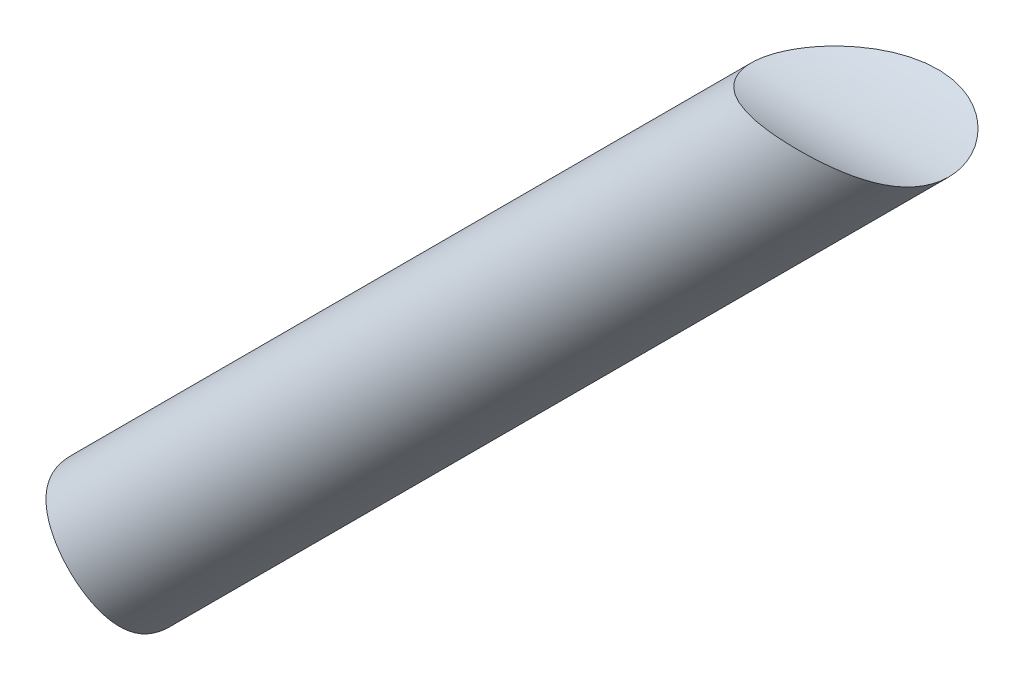
ISO-10303-21;
HEADER;
FILE_DESCRIPTION(('STEP AP214'),'2;1');
FILE_NAME('part.step','',(''),(''),'','','');
FILE_SCHEMA(('AUTOMOTIVE_DESIGN { 1 0 10303 214 1 1 1 1 }'));
ENDSEC;
DATA;
#1=APPLICATION_CONTEXT('core data for automotive mechanical design processes');
#2=APPLICATION_PROTOCOL_DEFINITION('international standard','automotive_design',2000,#1);
#3=PRODUCT_CONTEXT('',#1,'mechanical');
#4=PRODUCT('Part','Part','',(#3));
#5=PRODUCT_RELATED_PRODUCT_CATEGORY('part','',(#4));
#6=PRODUCT_DEFINITION_FORMATION('','',#4);
#7=PRODUCT_DEFINITION_CONTEXT('part definition',#1,'design');
#8=PRODUCT_DEFINITION('design','',#6,#7);
#9=PRODUCT_DEFINITION_SHAPE('','',#8);
#10=(LENGTH_UNIT() NAMED_UNIT(*) SI_UNIT(.MILLI.,.METRE.));
#11=(NAMED_UNIT(*) PLANE_ANGLE_UNIT() SI_UNIT($,.RADIAN.));
#12=(NAMED_UNIT(*) SI_UNIT($,.STERADIAN.) SOLID_ANGLE_UNIT());
#13=UNCERTAINTY_MEASURE_WITH_UNIT(LENGTH_MEASURE(1.E-05),#10,'distance_accuracy_value','');
#14=(GEOMETRIC_REPRESENTATION_CONTEXT(3) GLOBAL_UNCERTAINTY_ASSIGNED_CONTEXT((#13)) GLOBAL_UNIT_ASSIGNED_CONTEXT((#10,
#11,#12)) REPRESENTATION_CONTEXT('',''));
#15=CARTESIAN_POINT('',(0.,0.,0.));
#16=DIRECTION('',(0.,0.,1.));
#17=DIRECTION('',(1.,0.,0.));
#18=AXIS2_PLACEMENT_3D('',#15,#16,#17);
#19=CARTESIAN_POINT('',(77.0746391493327,77.0746391493346,10.));
#20=DIRECTION('',(-0.707106781186539,-0.707106781186556,0.));
#21=DIRECTION('',(0.707106781186556,-0.707106781186539,0.));
#22=AXIS2_PLACEMENT_3D('',#19,#20,#21);
#23=CYLINDRICAL_SURFACE('',#22,6.);
#24=CARTESIAN_POINT('',(75.8852813742368,67.4,10.));
#25=CARTESIAN_POINT('',(75.8852815124754,67.3999997379302,10.1598395629172));
#26=CARTESIAN_POINT('',(75.8793139100281,67.4030717450478,10.3196746745707));
#27=CARTESIAN_POINT('',(75.8554485569094,67.4152882815271,10.6382732568473));
#28=CARTESIAN_POINT('',(75.8375469340924,67.4244347818321,10.79703636275));
#29=CARTESIAN_POINT('',(75.7898455430541,67.4485801839576,11.1122611799213));
#30=CARTESIAN_POINT('',(75.7600496391315,67.4635771849897,11.2687236215449));
#31=CARTESIAN_POINT('',(75.6886151960445,67.4990611378244,11.5782861987423));
#32=CARTESIAN_POINT('',(75.6469767571852,67.5195480431279,11.7313863627822));
#33=CARTESIAN_POINT('',(75.551917569648,67.5655248889617,12.0332358016263));
#34=CARTESIAN_POINT('',(75.498488471756,67.5910183733407,12.1819819082648));
#35=CARTESIAN_POINT('',(75.3800368555393,67.6463493130862,12.4738846953391));
#36=CARTESIAN_POINT('',(75.3150185010834,67.6761852075772,12.6170433608255));
#37=CARTESIAN_POINT('',(75.1736009993334,67.7394446151721,12.8968020386602));
#38=CARTESIAN_POINT('',(75.097201578007,67.772868214655,13.0334018929812));
#39=CARTESIAN_POINT('',(74.9333504344412,67.8424308664143,13.2990732520277));
#40=CARTESIAN_POINT('',(74.8458988164286,67.8785698930818,13.4281448277313));
#41=CARTESIAN_POINT('',(74.6610648914562,67.9523416640405,13.6769800864918));
#42=CARTESIAN_POINT('',(74.5637592786814,67.9899616612996,13.796804533844));
#43=CARTESIAN_POINT('',(74.3592697772185,68.0659608607829,14.0274388624029));
#44=CARTESIAN_POINT('',(74.2520860232616,68.1043400526465,14.1382488665218));
#45=CARTESIAN_POINT('',(74.0285665029494,68.1808707478997,14.3502544705578));
#46=CARTESIAN_POINT('',(73.9122323449758,68.219022290041,14.451451753246));
#47=CARTESIAN_POINT('',(73.6712322231011,68.2941685681328,14.6438503304824));
#48=CARTESIAN_POINT('',(73.546566126058,68.3311632855837,14.7350514652337));
#49=CARTESIAN_POINT('',(73.2883181776644,68.4035701266641,14.9082611786457));
#50=CARTESIAN_POINT('',(73.1546487558198,68.438958538182,14.9901491114724));
#51=CARTESIAN_POINT('',(72.8807532491288,68.5069513884321,15.1434863123765));
#52=CARTESIAN_POINT('',(72.7405246171624,68.5395547315209,15.2149314800679));
#53=CARTESIAN_POINT('',(72.3115478223366,68.632241684167,15.4138029293905));
#54=CARTESIAN_POINT('',(72.0143869119642,68.687237065026,15.5258454385129));
#55=CARTESIAN_POINT('',(71.4931284475694,68.767430204055,15.6851803480726));
#56=CARTESIAN_POINT('',(71.2723494631297,68.796653208636,15.7418259199196));
#57=CARTESIAN_POINT('',(70.8259284561198,68.8465449488436,15.8372989235558));
#58=CARTESIAN_POINT('',(70.600284640212,68.867210471149,15.8761196627426));
#59=CARTESIAN_POINT('',(70.1458551623118,68.9001656181015,15.9375793161572));
#60=CARTESIAN_POINT('',(69.9170646643161,68.9124404180457,15.9601895932124));
#61=CARTESIAN_POINT('',(69.4582639582783,68.929045593545,15.9906958728094));
#62=CARTESIAN_POINT('',(69.2282537282401,68.93337582534,15.9985916090861));
#63=CARTESIAN_POINT('',(68.6538423448143,68.9350593480121,16.0016800248726));
#64=CARTESIAN_POINT('',(68.3093722611774,68.9278785791995,15.9886145894551));
#65=CARTESIAN_POINT('',(67.6229692400315,68.899511111573,15.9363338883472));
#66=CARTESIAN_POINT('',(67.2810378190434,68.8783166306561,15.897104092943));
#67=CARTESIAN_POINT('',(66.6004980883175,68.8241755290441,15.7947797275722));
#68=CARTESIAN_POINT('',(66.2619060033377,68.7911872165515,15.7316004465558));
#69=CARTESIAN_POINT('',(65.5908913248172,68.7156703682455,15.5828063567638));
#70=CARTESIAN_POINT('',(65.2584672525322,68.6731441519405,15.4971970018741));
#71=CARTESIAN_POINT('',(64.5853568561204,68.5783198236792,15.2992631259023));
#72=CARTESIAN_POINT('',(64.2450427121643,68.5256499541495,15.1858512865817));
#73=CARTESIAN_POINT('',(63.5745307864571,68.4141405315763,14.9339718895182));
#74=CARTESIAN_POINT('',(63.2443386933048,68.3552975885248,14.7954905339795));
#75=CARTESIAN_POINT('',(62.7600688148906,68.2642598676447,14.5679461220187));
#76=CARTESIAN_POINT('',(62.6008957522202,68.2335381458015,14.4890331048443));
#77=CARTESIAN_POINT('',(62.2864055248103,68.1714161151899,14.3241294868241));
#78=CARTESIAN_POINT('',(62.1310877518616,68.1400159149389,14.2381400117143));
#79=CARTESIAN_POINT('',(61.8251114334625,68.0768876757817,14.0587005774971));
#80=CARTESIAN_POINT('',(61.6744480740916,68.0451600241946,13.9652587108124));
#81=CARTESIAN_POINT('',(61.3784891672176,67.9817140138422,13.7702750133171));
#82=CARTESIAN_POINT('',(61.2331920832487,67.9499956550373,13.668735527729));
#83=CARTESIAN_POINT('',(60.987678935671,67.8955562170633,13.4856562966612));
#84=CARTESIAN_POINT('',(60.8859462583414,67.8727334989394,13.4061845234753));
#85=CARTESIAN_POINT('',(60.6864872119403,67.827522118368,13.2422980622385));
#86=CARTESIAN_POINT('',(60.5887604835964,67.805133417091,13.157883819108));
#87=CARTESIAN_POINT('',(60.3022483021664,67.7388767037206,12.8964652461113));
#88=CARTESIAN_POINT('',(60.1202993823323,67.6959556948688,12.7114081820063));
#89=CARTESIAN_POINT('',(59.8660324980736,67.6351085156795,12.415102731241));
#90=CARTESIAN_POINT('',(59.7839498347091,67.6153069088888,12.3125393055681));
#91=CARTESIAN_POINT('',(59.6277712538589,67.5773864073786,12.1011278518762));
#92=CARTESIAN_POINT('',(59.553676330093,67.5592677220627,11.992279044501));
#93=CARTESIAN_POINT('',(59.4152242581805,67.5252272133797,11.7685466071954));
#94=CARTESIAN_POINT('',(59.3508441893598,67.5093002271249,11.6536780715942));
#95=CARTESIAN_POINT('',(59.2334189174398,67.4801242194581,11.4180218974718));
#96=CARTESIAN_POINT('',(59.1803672721936,67.4668736762634,11.2972376713369));
#97=CARTESIAN_POINT('',(59.0705652167238,67.4393621061804,11.0054728110215));
#98=CARTESIAN_POINT('',(59.0194454845528,67.4264760233515,10.8321679559407));
#99=CARTESIAN_POINT('',(58.9460570273946,67.4079439181919,10.4792482671981));
#100=CARTESIAN_POINT('',(58.923758805838,67.4022904938599,10.2996400782405));
#101=CARTESIAN_POINT('',(58.910161080693,67.3988453565914,9.93866913021494));
#102=CARTESIAN_POINT('',(58.9189415258144,67.4010739197622,9.75730304459917));
#103=CARTESIAN_POINT('',(58.9667520148335,67.4131714635371,9.39885669047514));
#104=CARTESIAN_POINT('',(59.005805028596,67.4230462458435,9.22177978171849));
#105=CARTESIAN_POINT('',(59.1218840762085,67.4522456510986,8.83906439317466));
#106=CARTESIAN_POINT('',(59.2052839304874,67.4731491754544,8.63550403931217));
#107=CARTESIAN_POINT('',(59.4030072662934,67.5222434546702,8.24496809809244));
#108=CARTESIAN_POINT('',(59.517388294476,67.5504477661711,8.0580242423762));
#109=CARTESIAN_POINT('',(59.7401382297937,67.6047268071969,7.74265207051718));
#110=CARTESIAN_POINT('',(59.8438286343237,67.6297968811766,7.6106607275377));
#111=CARTESIAN_POINT('',(60.0621688151239,67.6820429299041,7.35644640916479));
#112=CARTESIAN_POINT('',(60.1768247830611,67.709220092753,7.23422902496779));
#113=CARTESIAN_POINT('',(60.4150689129569,67.7650275226496,6.99881588743163));
#114=CARTESIAN_POINT('',(60.5386726351652,67.7936602939685,6.88563660670132));
#115=CARTESIAN_POINT('',(60.7930177703062,67.8517965539926,6.66781042996424));
#116=CARTESIAN_POINT('',(60.9237618105869,67.8813003613441,6.56316671049848));
#117=CARTESIAN_POINT('',(61.295952643645,67.9640342134289,6.2827516566759));
#118=CARTESIAN_POINT('',(61.5437916030401,68.0177222898052,6.11557182319901));
#119=CARTESIAN_POINT('',(62.0530897590377,68.1244608550145,5.80311011898068));
#120=CARTESIAN_POINT('',(62.3145595524975,68.1775108071082,5.65784563780407));
#121=CARTESIAN_POINT('',(62.8483651496075,68.2815171778423,5.3867635058964));
#122=CARTESIAN_POINT('',(63.120720000812,68.3324695787923,5.26098200675687));
#123=CARTESIAN_POINT('',(63.6736282237214,68.4308223401642,5.0276802470737));
#124=CARTESIAN_POINT('',(63.9541793629931,68.478223655491,4.92015506739312));
#125=CARTESIAN_POINT('',(64.5466907982359,68.5721258507796,4.713867368748));
#126=CARTESIAN_POINT('',(64.8592657887626,68.618192560341,4.61667220284539));
#127=CARTESIAN_POINT('',(65.4910307994879,68.70300170511,4.44242779824431));
#128=CARTESIAN_POINT('',(65.8102221967229,68.7417425983029,4.36538279966019));
#129=CARTESIAN_POINT('',(66.453401363601,68.810057367316,4.23209137269348));
#130=CARTESIAN_POINT('',(66.7773811882099,68.8396449572769,4.17581380440784));
#131=CARTESIAN_POINT('',(67.4291870734347,68.8877874067195,4.08528684393991));
#132=CARTESIAN_POINT('',(67.7570117360719,68.9063461567617,4.05102968343622));
#133=CARTESIAN_POINT('',(68.3213579603817,68.9269551091747,4.01313264977109));
#134=CARTESIAN_POINT('',(68.5573708929337,68.9321967188805,4.00356078494131));
#135=CARTESIAN_POINT('',(69.0296423402265,68.9351949991782,3.99807707881385));
#136=CARTESIAN_POINT('',(69.2659008500615,68.9329518165251,4.002164969688));
#137=CARTESIAN_POINT('',(69.737221855235,68.9202685181246,4.02541412598633));
#138=CARTESIAN_POINT('',(69.9722853990614,68.9098376513099,4.04455838355646));
#139=CARTESIAN_POINT('',(70.4399111998853,68.8802141031314,4.09954948561711));
#140=CARTESIAN_POINT('',(70.6724740101207,68.8610234022988,4.13539255467224));
#141=CARTESIAN_POINT('',(71.0860384413827,68.8184432435308,4.21634041354156));
#142=CARTESIAN_POINT('',(71.2678738334506,68.7967107419533,4.2580606530241));
#143=CARTESIAN_POINT('',(71.627399977225,68.7475821624634,4.35407292349448));
#144=CARTESIAN_POINT('',(71.8050917612385,68.7201875123192,4.40836178559063));
#145=CARTESIAN_POINT('',(72.1548517607636,68.6600365243145,4.53027999060202));
#146=CARTESIAN_POINT('',(72.3269221608237,68.6272822997234,4.5979040776121));
#147=CARTESIAN_POINT('',(72.6639151881279,68.556987607884,4.74710871478473));
#148=CARTESIAN_POINT('',(72.8288378040491,68.5194471330541,4.82868928705489));
#149=CARTESIAN_POINT('',(73.1512437663602,68.4401345814324,5.00689764002309));
#150=CARTESIAN_POINT('',(73.3086507429652,68.3983288215565,5.10364905101125));
#151=CARTESIAN_POINT('',(73.6127976010068,68.3119842686393,5.311656983295));
#152=CARTESIAN_POINT('',(73.7595372330361,68.2674454117418,5.42291384356491));
#153=CARTESIAN_POINT('',(74.0407497600931,68.1771233512998,5.65947258877787));
#154=CARTESIAN_POINT('',(74.175225804724,68.1313404711951,5.78477084900038));
#155=CARTESIAN_POINT('',(74.4306102140519,68.04014965377,6.04861901582392));
#156=CARTESIAN_POINT('',(74.5515202824194,67.9947416700336,6.18716725438153));
#157=CARTESIAN_POINT('',(74.7633491186308,67.9119720158973,6.45679539239527));
#158=CARTESIAN_POINT('',(74.8561126082869,67.8743524701612,6.58635268184652));
#159=CARTESIAN_POINT('',(75.0301932952715,67.8016762938402,6.85361593032828));
#160=CARTESIAN_POINT('',(75.1115111945609,67.7666195061442,6.99132138889319));
#161=CARTESIAN_POINT('',(75.2623211302989,67.7000269331917,7.27388092529851));
#162=CARTESIAN_POINT('',(75.331812543797,67.668491333441,7.41873537918834));
#163=CARTESIAN_POINT('',(75.4587011340757,67.6097903044356,7.7145071202974));
#164=CARTESIAN_POINT('',(75.5160976750283,67.5826251049509,7.86542472576048));
#165=CARTESIAN_POINT('',(75.6201915512146,67.532625973984,8.1769000415228));
#166=CARTESIAN_POINT('',(75.6665055833312,67.5099509282622,8.33761148378618));
#167=CARTESIAN_POINT('',(75.7459685443341,67.4706301806932,8.66298092288616));
#168=CARTESIAN_POINT('',(75.7791170669798,67.4539846648971,8.8276390413369));
#169=CARTESIAN_POINT('',(75.8321773154528,67.4271719738417,9.15959034606917));
#170=CARTESIAN_POINT('',(75.8520892572382,67.4170046928885,9.32688348931401));
#171=CARTESIAN_POINT('',(75.8786409075299,67.4034189998845,9.66278611337812));
#172=CARTESIAN_POINT('',(75.8852812284179,67.4000002764406,9.83139553310109));
#173=CARTESIAN_POINT('',(75.8852813742368,67.4,10.));
#174=B_SPLINE_CURVE_WITH_KNOTS('',3,(#24,#25,#26,#27,#28,#29,#30,#31,#32,#33,#34,#35,#36,#37,
#38,#39,#40,#41,#42,#43,#44,#45,#46,#47,#48,#49,#50,#51,#52,#53,#54,#55,#56,#57,#58,#59,#60,#61,
#62,#63,#64,#65,#66,#67,#68,#69,#70,#71,#72,#73,#74,#75,#76,#77,#78,#79,#80,#81,#82,#83,#84,#85,
#86,#87,#88,#89,#90,#91,#92,#93,#94,#95,#96,#97,#98,#99,#100,#101,#102,#103,#104,#105,#106,#107,
#108,#109,#110,#111,#112,#113,#114,#115,#116,#117,#118,#119,#120,#121,#122,#123,#124,#125,#126,
#127,#128,#129,#130,#131,#132,#133,#134,#135,#136,#137,#138,#139,#140,#141,#142,#143,#144,#145,
#146,#147,#148,#149,#150,#151,#152,#153,#154,#155,#156,#157,#158,#159,#160,#161,#162,#163,#164,
#165,#166,#167,#168,#169,#170,#171,#172,#173),.UNSPECIFIED.,.T.,.F.,(4,2,2,2,2,2,2,2,2,2,2,2,2,
2,2,2,2,2,2,2,2,2,2,2,2,2,2,2,2,2,2,2,2,2,2,2,2,2,2,2,2,2,2,2,2,2,2,2,2,2,2,2,2,2,2,2,2,2,2,2,2,
2,2,2,2,2,2,2,2,2,2,2,2,2,4),(0.,0.479370312012818,0.958896237606557,1.43826649803438,
1.91763269836793,2.39733944350974,2.87687418241217,3.35642046937655,3.83596223436,
4.31202303912531,4.78807735170664,5.2640481736251,5.74002660322964,6.22159953628903,
6.70336105547851,7.66643873458003,8.3549919755339,9.04380353321576,9.73382895720589,
10.4238668673464,11.4566648267743,12.4900368024333,13.5270985200153,14.563908309061,
15.6506102744644,16.7379121689329,17.2786592410904,17.8193204558792,18.3594023671161,
18.8993284246132,19.292461971262,19.685560182338,20.4723902465014,20.8706283127834,
21.2689158650939,21.6662485121655,22.0633546023439,22.6044135075683,23.1449182415946,
23.6868144132784,24.2291221615495,24.8884067089782,25.5489243578605,26.0573737285476,
26.5661119077081,27.0757570864119,27.5855910742407,28.495330417664,29.4057878737984,
30.3179149949504,31.2297959534806,32.2207162090707,33.211844812352,34.2014811616237,
35.1907681968115,35.8991218609331,36.6074616363763,37.315002409898,38.022383293053,
38.5853544270075,39.1481837749054,39.7107917327347,40.273400581765,40.8408585065509,
41.4083296945008,41.9756547284537,42.5429084354824,43.0334732113224,43.5240078875823,
44.0145683943662,44.5051546835081,45.0108275534495,45.5165160254394,46.0221962467934,
46.5278531344187),.UNSPECIFIED.);
#175=CARTESIAN_POINT('',(75.8852813742368,67.4,10.));
#176=VERTEX_POINT('',#175);
#177=EDGE_CURVE('E10',#176,#176,#174,.T.);
#178=ORIENTED_EDGE('',*,*,#177,.T.);
#179=EDGE_LOOP('',(#178));
#180=FACE_BOUND('',#179,.T.);
#181=CARTESIAN_POINT('',(8.98605717737184,0.500775803133386,10.));
#182=CARTESIAN_POINT('',(8.98605748508666,0.500776715105243,9.85353533955458));
#183=CARTESIAN_POINT('',(8.98566431542602,0.507983001174149,9.70705852058332));
#184=CARTESIAN_POINT('',(8.98400319168465,0.536550250595204,9.41549334836636));
#185=CARTESIAN_POINT('',(8.98273509810425,0.557913471136532,9.27040522027707));
#186=CARTESIAN_POINT('',(8.97906773699204,0.614109950410626,8.9826964860356));
#187=CARTESIAN_POINT('',(8.97666703582628,0.648960270791826,8.84007924535678));
#188=CARTESIAN_POINT('',(8.9703522750901,0.731075186532771,8.55847442040169));
#189=CARTESIAN_POINT('',(8.96643744082747,0.778346132814749,8.41948873310037));
#190=CARTESIAN_POINT('',(8.95182310530101,0.935899861828673,8.0119839541291));
#191=CARTESIAN_POINT('',(8.9382330667686,1.0625811491345,7.74978239628315));
#192=CARTESIAN_POINT('',(8.89932142802268,1.35022834063619,7.2463570070115));
#193=CARTESIAN_POINT('',(8.87399739049877,1.51120136393503,7.005137546221));
#194=CARTESIAN_POINT('',(8.80237997053112,1.88680036029616,6.50904968030411));
#195=CARTESIAN_POINT('',(8.75343614164094,2.10587755876238,6.25790125136211));
#196=CARTESIAN_POINT('',(8.65995526376616,2.45350508863379,5.90553487710377));
#197=CARTESIAN_POINT('',(8.625416005795,2.57264988351927,5.79205984776456));
#198=CARTESIAN_POINT('',(8.54895390301103,2.81632202456468,5.57357874104262));
#199=CARTESIAN_POINT('',(8.50702950204676,2.94085050095928,5.46857445537456));
#200=CARTESIAN_POINT('',(8.40852143722022,3.21256471971153,5.25302356570355));
#201=CARTESIAN_POINT('',(8.3506936683514,3.36041770276928,5.14388076601325));
#202=CARTESIAN_POINT('',(8.2237705104555,3.66006213814201,4.93842334985244));
#203=CARTESIAN_POINT('',(8.15468034039802,3.81185173897092,4.84210282894858));
#204=CARTESIAN_POINT('',(8.00462614788177,4.11763839804422,4.66337186290874));
#205=CARTESIAN_POINT('',(7.9236686741983,4.27163419681577,4.58095379953703));
#206=CARTESIAN_POINT('',(7.7495004367911,4.58001932261517,4.43116821944084));
#207=CARTESIAN_POINT('',(7.65629230455013,4.73440855816723,4.36379747886613));
#208=CARTESIAN_POINT('',(7.46877824194229,5.02431364866204,4.25193277800074));
#209=CARTESIAN_POINT('',(7.37576719693979,5.16000471137216,4.20572075155552));
#210=CARTESIAN_POINT('',(7.18039517201674,5.42858051473185,4.12683883465592));
#211=CARTESIAN_POINT('',(7.07803482338081,5.56146544411257,4.09416803069345));
#212=CARTESIAN_POINT('',(6.86469359412446,5.82274837614251,4.04299075998501));
#213=CARTESIAN_POINT('',(6.753721871875,5.9511509406826,4.02446946634038));
#214=CARTESIAN_POINT('',(6.52399818559896,6.20212639834889,4.00190057905336));
#215=CARTESIAN_POINT('',(6.40524732173902,6.32470011160782,3.99785094323472));
#216=CARTESIAN_POINT('',(6.17979847442522,6.54453802199324,4.00380386394787));
#217=CARTESIAN_POINT('',(6.07402295848694,6.64281189889591,4.0117582601211));
#218=CARTESIAN_POINT('',(5.85855891564711,6.83359303029516,4.03799884751359));
#219=CARTESIAN_POINT('',(5.74886916484896,6.92609845583632,4.05628829727489));
#220=CARTESIAN_POINT('',(5.52656630989229,7.10474452877348,4.10294041323731));
#221=CARTESIAN_POINT('',(5.41395424614452,7.19088740048921,4.1312995387975));
#222=CARTESIAN_POINT('',(5.18666118239224,7.35651623529629,4.19773514426556));
#223=CARTESIAN_POINT('',(5.07197939614468,7.43599960101577,4.23581539243375));
#224=CARTESIAN_POINT('',(4.84201837347689,7.5877365732828,4.32105185736134));
#225=CARTESIAN_POINT('',(4.72674402982839,7.66002062940021,4.36816714681505));
#226=CARTESIAN_POINT('',(4.49595510550711,7.79772243609836,4.47109302065698));
#227=CARTESIAN_POINT('',(4.38044045458605,7.86313776218351,4.52690665819778));
#228=CARTESIAN_POINT('',(4.03486538226507,8.04910832500886,4.70661218914095));
#229=CARTESIAN_POINT('',(3.80560295549912,8.15949920836031,4.84283256169071));
#230=CARTESIAN_POINT('',(3.32598206487999,8.36749583132788,5.16394640953883));
#231=CARTESIAN_POINT('',(3.07681029984164,8.46151529724982,5.35288364781414));
#232=CARTESIAN_POINT('',(2.59651360058346,8.62103123008849,5.76371498955021));
#233=CARTESIAN_POINT('',(2.36541735916533,8.68648307433593,5.98565993133308));
#234=CARTESIAN_POINT('',(2.02179684657401,8.77092871123242,6.35917635569087));
#235=CARTESIAN_POINT('',(1.90038363104708,8.79787257762297,6.50092994883038));
#236=CARTESIAN_POINT('',(1.66815279163798,8.8448468219153,6.79394613102645));
#237=CARTESIAN_POINT('',(1.55733755331987,8.86487564590332,6.94521084835957));
#238=CARTESIAN_POINT('',(1.24408085642263,8.91609731835174,7.41229409891757));
#239=CARTESIAN_POINT('',(1.06013337626928,8.93857997349688,7.74213841668404));
#240=CARTESIAN_POINT('',(0.80459997577114,8.96461526136673,8.33424408902749));
#241=CARTESIAN_POINT('',(0.715931080922988,8.97173766558987,8.58895785799819));
#242=CARTESIAN_POINT('',(0.6153267107385,8.97900035560513,8.97918020995198));
#243=CARTESIAN_POINT('',(0.587196561503596,8.98085104201405,9.11055843084267));
#244=CARTESIAN_POINT('',(0.542398883299607,8.98366994067957,9.37529459255317));
#245=CARTESIAN_POINT('',(0.525731400655785,8.98463814936972,9.50865254137163));
#246=CARTESIAN_POINT('',(0.504312347600356,8.98586573518108,9.77692072440333));
#247=CARTESIAN_POINT('',(0.49961364911089,8.98612196760859,9.91183521059274));
#248=CARTESIAN_POINT('',(0.502424557579199,8.98596526355377,10.1815353067702));
#249=CARTESIAN_POINT('',(0.509934193809178,8.98555232546695,10.3163209164485));
#250=CARTESIAN_POINT('',(0.536944789347177,8.98397867548309,10.5847475286685));
#251=CARTESIAN_POINT('',(0.556451870985778,8.98281758178568,10.718387911471));
#252=CARTESIAN_POINT('',(0.606893173679524,8.9795494202355,10.9835024085941));
#253=CARTESIAN_POINT('',(0.637832202063527,8.97744195433666,11.114975587237));
#254=CARTESIAN_POINT('',(0.743052033240096,8.96954344316902,11.492007216002));
#255=CARTESIAN_POINT('',(0.831278729539247,8.96214423356105,11.7337383135175));
#256=CARTESIAN_POINT('',(1.03959703488613,8.94036463573213,12.2024235381302));
#257=CARTESIAN_POINT('',(1.159699344214,8.92598190187434,12.4293726711699));
#258=CARTESIAN_POINT('',(1.45199733482331,8.88355905183044,12.9105841709742));
#259=CARTESIAN_POINT('',(1.62980710676585,8.85336372371296,13.1612388836525));
#260=CARTESIAN_POINT('',(2.01336621522275,8.77409463424757,13.6372819974521));
#261=CARTESIAN_POINT('',(2.21914948888563,8.72499780716688,13.8626390918968));
#262=CARTESIAN_POINT('',(2.56676624018393,8.62731018148383,14.2030631410588));
#263=CARTESIAN_POINT('',(2.70222566369532,8.58599546558213,14.3268563705124));
#264=CARTESIAN_POINT('',(2.97927512209322,8.4938332465648,14.5635350859104));
#265=CARTESIAN_POINT('',(3.12086335910756,8.44298852467249,14.6764237397019));
#266=CARTESIAN_POINT('',(3.40863813546259,8.33096778423523,14.8904761144477));
#267=CARTESIAN_POINT('',(3.55482254815174,8.26979648817781,14.9916451594427));
#268=CARTESIAN_POINT('',(3.85030353985587,8.1364251253218,15.1813651954553));
#269=CARTESIAN_POINT('',(3.99959927201532,8.06422802658531,15.2699195698837));
#270=CARTESIAN_POINT('',(4.27082620353105,7.92330184538411,15.4176597669847));
#271=CARTESIAN_POINT('',(4.39250659412256,7.8565693175159,15.4792197033721));
#272=CARTESIAN_POINT('',(4.63586949460448,7.71547053617401,15.5928276352721));
#273=CARTESIAN_POINT('',(4.75755199912423,7.64110582407131,15.6448775455181));
#274=CARTESIAN_POINT('',(4.99984918890377,7.48480314273828,15.7388635850186));
#275=CARTESIAN_POINT('',(5.12046449755448,7.40286996546244,15.7808060538774));
#276=CARTESIAN_POINT('',(5.35964844664254,7.23158365183555,15.8540865879077));
#277=CARTESIAN_POINT('',(5.47821705736491,7.14223040786553,15.8854244992397));
#278=CARTESIAN_POINT('',(5.71275174564379,6.95607508169427,15.9371681578718));
#279=CARTESIAN_POINT('',(5.82870368490285,6.85924124227127,15.9575239967584));
#280=CARTESIAN_POINT('',(6.05637530908576,6.65907586107646,15.986774502487));
#281=CARTESIAN_POINT('',(6.16809498730894,6.55574430901791,15.995669151184));
#282=CARTESIAN_POINT('',(6.38629654944063,6.34337399971892,16.001854831984));
#283=CARTESIAN_POINT('',(6.49277874499912,6.23433558285733,15.9991465553517));
#284=CARTESIAN_POINT('',(6.69963992086908,6.01148369331323,15.9821711851083));
#285=CARTESIAN_POINT('',(6.80001917871507,5.89767043816757,15.9679046175401));
#286=CARTESIAN_POINT('',(6.98688977241233,5.67476499767939,15.9294974262782));
#287=CARTESIAN_POINT('',(7.07385997828289,5.56593510521711,15.9061540573999));
#288=CARTESIAN_POINT('',(7.24158560978146,5.34589414652316,15.8500229539068));
#289=CARTESIAN_POINT('',(7.32233891603668,5.23468228463611,15.817232016476));
#290=CARTESIAN_POINT('',(7.4773176587121,5.01081259249963,15.7426038656972));
#291=CARTESIAN_POINT('',(7.55154505928831,4.89815520909998,15.7007693874612));
#292=CARTESIAN_POINT('',(7.69340351486184,4.67219185873221,15.6084944653482));
#293=CARTESIAN_POINT('',(7.76103201694917,4.55888565856263,15.5580507113929));
#294=CARTESIAN_POINT('',(7.96136729200874,4.20621616628193,15.3882336102895));
#295=CARTESIAN_POINT('',(8.08266579292347,3.96700646174869,15.2546624130753));
#296=CARTESIAN_POINT('',(8.29715767010434,3.496329495457,14.955534722562));
#297=CARTESIAN_POINT('',(8.39033414348089,3.26486696418471,14.7899590905111));
#298=CARTESIAN_POINT('',(8.56423679074711,2.7802880495803,14.4021174657146));
#299=CARTESIAN_POINT('',(8.64069991415427,2.52949158901817,14.1750310614749));
#300=CARTESIAN_POINT('',(8.76558146870231,2.05541500564543,13.6866592427667));
#301=CARTESIAN_POINT('',(8.81397896891916,1.83215551693998,13.425348481859));
#302=CARTESIAN_POINT('',(8.88615693534993,1.43976135134894,12.8923938578693));
#303=CARTESIAN_POINT('',(8.91153454747748,1.2677959757666,12.6230614920584));
#304=CARTESIAN_POINT('',(8.94907137403238,0.967993764628033,12.060159705955));
#305=CARTESIAN_POINT('',(8.96125634539022,0.840071275426004,11.766638721549));
#306=CARTESIAN_POINT('',(8.97588821441748,0.663015879892927,11.2276476092741));
#307=CARTESIAN_POINT('',(8.97989496499691,0.602703722460836,10.9859480951284));
#308=CARTESIAN_POINT('',(8.98369509124213,0.54183007808923,10.6186608270821));
#309=CARTESIAN_POINT('',(8.98459345159414,0.526471254538798,10.4954328923675));
#310=CARTESIAN_POINT('',(8.985774287632,0.505944999806338,10.2481394026301));
#311=CARTESIAN_POINT('',(8.98605691669852,0.500775030578054,10.1240740639336));
#312=CARTESIAN_POINT('',(8.98605717737184,0.500775803133386,10.));
#313=B_SPLINE_CURVE_WITH_KNOTS('',3,(#181,#182,#183,#184,#185,#186,#187,#188,#189,#190,#191,
#192,#193,#194,#195,#196,#197,#198,#199,#200,#201,#202,#203,#204,#205,#206,#207,#208,#209,#210,
#211,#212,#213,#214,#215,#216,#217,#218,#219,#220,#221,#222,#223,#224,#225,#226,#227,#228,#229,
#230,#231,#232,#233,#234,#235,#236,#237,#238,#239,#240,#241,#242,#243,#244,#245,#246,#247,#248,
#249,#250,#251,#252,#253,#254,#255,#256,#257,#258,#259,#260,#261,#262,#263,#264,#265,#266,#267,
#268,#269,#270,#271,#272,#273,#274,#275,#276,#277,#278,#279,#280,#281,#282,#283,#284,#285,#286,
#287,#288,#289,#290,#291,#292,#293,#294,#295,#296,#297,#298,#299,#300,#301,#302,#303,#304,#305,
#306,#307,#308,#309,#310,#311,#312),.UNSPECIFIED.,.T.,.F.,(4,2,2,2,2,2,2,2,2,2,2,2,2,2,2,2,2,2,
2,2,2,2,2,2,2,2,2,2,2,2,2,2,2,2,2,2,2,2,2,2,2,2,2,2,2,2,2,2,2,2,2,2,2,2,2,2,2,2,2,2,2,2,2,2,2,
4),(0.,0.439240150409468,0.878550350357974,1.31841811918743,1.75851124064944,2.6292120675204,
3.50009383186805,4.50653442593667,5.01054126635932,5.51465443528811,6.09185845532067,
6.66879575682003,7.24541587524922,7.82191233554225,8.3337696371672,8.84559240262553,
9.3568781040624,9.86809165227609,10.3013698482864,10.7347847289874,11.1680473655284,
11.6014782061121,12.0329901708468,12.4646539404424,13.3273472883367,14.3034047596265,
15.2809814251161,15.8460989386011,16.4113433599406,17.5387963471108,18.3447649668321,
18.7474252937555,19.1500872479824,19.5545248946393,19.9589635110271,20.3636086850332,
20.7684242132609,21.5376094574635,22.3070532356934,23.2302928079152,24.1546626103899,
24.7183861875473,25.2819455038577,25.8452477912967,26.4083987084702,26.863402830762,
27.3183152420583,27.7729415755108,28.227574503913,28.6842564865101,29.1409391921127,
29.5975946904145,30.0542294064946,30.4775136660117,30.900941592126,31.3242416361888,
31.7477047980237,32.6428008508155,33.5384338391711,34.574931149774,35.6122004737967,
36.570288735159,37.5265030607641,38.270763450415,38.642948050999,39.0150399285781),.UNSPECIFIED.);
#314=CARTESIAN_POINT('',(8.98605717737184,0.500775803133386,10.));
#315=VERTEX_POINT('',#314);
#316=EDGE_CURVE('E44',#315,#315,#313,.T.);
#317=ORIENTED_EDGE('',*,*,#316,.T.);
#318=EDGE_LOOP('',(#317));
#319=FACE_BOUND('',#318,.T.);
#320=ADVANCED_FACE('F35',(#180,#319),#23,.T.);
#321=CARTESIAN_POINT('',(-81.3172798364521,79.9,10.));
#322=DIRECTION('',(1.,0.,0.));
#323=DIRECTION('',(0.,0.,-1.));
#324=AXIS2_PLACEMENT_3D('',#321,#322,#323);
#325=CYLINDRICAL_SURFACE('',#324,12.5);
#326=ORIENTED_EDGE('',*,*,#177,.F.);
#327=EDGE_LOOP('',(#326));
#328=FACE_BOUND('',#327,.T.);
#329=ADVANCED_FACE('F56',(#328),#325,.F.);
#330=CARTESIAN_POINT('',(0.,0.,0.));
#331=DIRECTION('',(0.,0.,1.));
#332=DIRECTION('',(1.,0.,0.));
#333=AXIS2_PLACEMENT_3D('',#330,#331,#332);
#334=CYLINDRICAL_SURFACE('',#333,9.);
#335=ORIENTED_EDGE('',*,*,#316,.F.);
#336=EDGE_LOOP('',(#335));
#337=FACE_BOUND('',#336,.T.);
#338=ADVANCED_FACE('F53',(#337),#334,.F.);
#339=CLOSED_SHELL('',(#320,#329,#338));
#340=MANIFOLD_SOLID_BREP('B2',#339);
#341=ADVANCED_BREP_SHAPE_REPRESENTATION('',(#18,#340),#14);
#342=SHAPE_DEFINITION_REPRESENTATION(#9,#341);
ENDSEC;
END-ISO-10303-21;
